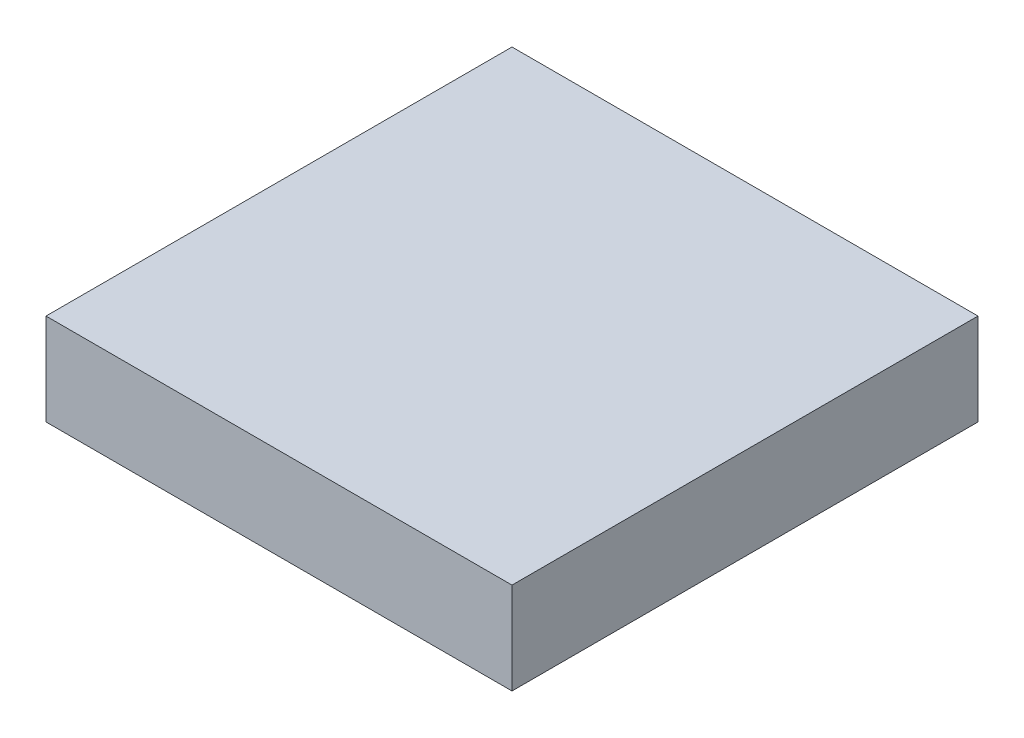
ISO-10303-21;
HEADER;
FILE_DESCRIPTION(('STEP AP214'),'2;1');
FILE_NAME('part.step','',(''),(''),'','','');
FILE_SCHEMA(('AUTOMOTIVE_DESIGN { 1 0 10303 214 1 1 1 1 }'));
ENDSEC;
DATA;
#1=APPLICATION_CONTEXT('core data for automotive mechanical design processes');
#2=APPLICATION_PROTOCOL_DEFINITION('international standard','automotive_design',2000,#1);
#3=PRODUCT_CONTEXT('',#1,'mechanical');
#4=PRODUCT('Part','Part','',(#3));
#5=PRODUCT_RELATED_PRODUCT_CATEGORY('part','',(#4));
#6=PRODUCT_DEFINITION_FORMATION('','',#4);
#7=PRODUCT_DEFINITION_CONTEXT('part definition',#1,'design');
#8=PRODUCT_DEFINITION('design','',#6,#7);
#9=PRODUCT_DEFINITION_SHAPE('','',#8);
#10=(LENGTH_UNIT() NAMED_UNIT(*) SI_UNIT(.MILLI.,.METRE.));
#11=(NAMED_UNIT(*) PLANE_ANGLE_UNIT() SI_UNIT($,.RADIAN.));
#12=(NAMED_UNIT(*) SI_UNIT($,.STERADIAN.) SOLID_ANGLE_UNIT());
#13=UNCERTAINTY_MEASURE_WITH_UNIT(LENGTH_MEASURE(1.E-05),#10,'distance_accuracy_value','');
#14=(GEOMETRIC_REPRESENTATION_CONTEXT(3) GLOBAL_UNCERTAINTY_ASSIGNED_CONTEXT((#13)) GLOBAL_UNIT_ASSIGNED_CONTEXT((#10,
#11,#12)) REPRESENTATION_CONTEXT('',''));
#15=CARTESIAN_POINT('',(0.,0.,0.));
#16=DIRECTION('',(0.,0.,1.));
#17=DIRECTION('',(1.,0.,0.));
#18=AXIS2_PLACEMENT_3D('',#15,#16,#17);
#19=CARTESIAN_POINT('',(76.2,30.,76.2));
#20=DIRECTION('',(-1.,0.,0.));
#21=DIRECTION('',(0.,0.,1.));
#22=AXIS2_PLACEMENT_3D('',#19,#20,#21);
#23=PLANE('',#22);
#24=DIRECTION('',(0.,0.,-1.));
#25=VECTOR('',#24,1.);
#26=CARTESIAN_POINT('',(76.2,0.,76.2));
#27=LINE('',#26,#25);
#28=CARTESIAN_POINT('',(76.2,0.,76.2));
#29=VERTEX_POINT('',#28);
#30=CARTESIAN_POINT('',(76.2,0.,-76.2));
#31=VERTEX_POINT('',#30);
#32=EDGE_CURVE('E97',#29,#31,#27,.T.);
#33=ORIENTED_EDGE('',*,*,#32,.T.);
#34=DIRECTION('',(0.,-1.,0.));
#35=VECTOR('',#34,1.);
#36=CARTESIAN_POINT('',(76.2,30.,-76.2));
#37=LINE('',#36,#35);
#38=CARTESIAN_POINT('',(76.2,30.,-76.2));
#39=VERTEX_POINT('',#38);
#40=EDGE_CURVE('E11',#39,#31,#37,.T.);
#41=ORIENTED_EDGE('',*,*,#40,.F.);
#42=DIRECTION('',(0.,0.,-1.));
#43=VECTOR('',#42,1.);
#44=CARTESIAN_POINT('',(76.2,30.,76.2));
#45=LINE('',#44,#43);
#46=CARTESIAN_POINT('',(76.2,30.,76.2));
#47=VERTEX_POINT('',#46);
#48=EDGE_CURVE('E85',#47,#39,#45,.T.);
#49=ORIENTED_EDGE('',*,*,#48,.F.);
#50=DIRECTION('',(0.,-1.,0.));
#51=VECTOR('',#50,1.);
#52=CARTESIAN_POINT('',(76.2,30.,76.2));
#53=LINE('',#52,#51);
#54=EDGE_CURVE('E93',#47,#29,#53,.T.);
#55=ORIENTED_EDGE('',*,*,#54,.T.);
#56=EDGE_LOOP('',(#33,#41,#49,#55));
#57=FACE_BOUND('',#56,.T.);
#58=ADVANCED_FACE('F34',(#57),#23,.F.);
#59=CARTESIAN_POINT('',(-76.2,30.,-76.2));
#60=DIRECTION('',(0.,0.,1.));
#61=DIRECTION('',(1.,0.,0.));
#62=AXIS2_PLACEMENT_3D('',#59,#60,#61);
#63=PLANE('',#62);
#64=DIRECTION('',(-1.,0.,0.));
#65=VECTOR('',#64,1.);
#66=CARTESIAN_POINT('',(-76.2,0.,-76.2));
#67=LINE('',#66,#65);
#68=CARTESIAN_POINT('',(-76.2,0.,-76.2));
#69=VERTEX_POINT('',#68);
#70=EDGE_CURVE('E89',#31,#69,#67,.T.);
#71=ORIENTED_EDGE('',*,*,#70,.T.);
#72=DIRECTION('',(0.,-1.,0.));
#73=VECTOR('',#72,1.);
#74=CARTESIAN_POINT('',(-76.2,30.,-76.2));
#75=LINE('',#74,#73);
#76=CARTESIAN_POINT('',(-76.2,30.,-76.2));
#77=VERTEX_POINT('',#76);
#78=EDGE_CURVE('E42',#77,#69,#75,.T.);
#79=ORIENTED_EDGE('',*,*,#78,.F.);
#80=DIRECTION('',(-1.,0.,0.));
#81=VECTOR('',#80,1.);
#82=CARTESIAN_POINT('',(-76.2,30.,-76.2));
#83=LINE('',#82,#81);
#84=EDGE_CURVE('E80',#39,#77,#83,.T.);
#85=ORIENTED_EDGE('',*,*,#84,.F.);
#86=ORIENTED_EDGE('',*,*,#40,.T.);
#87=EDGE_LOOP('',(#71,#79,#85,#86));
#88=FACE_BOUND('',#87,.T.);
#89=ADVANCED_FACE('F88',(#88),#63,.F.);
#90=CARTESIAN_POINT('',(-76.2,30.,76.2));
#91=DIRECTION('',(1.,0.,0.));
#92=DIRECTION('',(0.,0.,-1.));
#93=AXIS2_PLACEMENT_3D('',#90,#91,#92);
#94=PLANE('',#93);
#95=DIRECTION('',(0.,0.,1.));
#96=VECTOR('',#95,1.);
#97=CARTESIAN_POINT('',(-76.2,0.,76.2));
#98=LINE('',#97,#96);
#99=CARTESIAN_POINT('',(-76.2,0.,76.2));
#100=VERTEX_POINT('',#99);
#101=EDGE_CURVE('E67',#69,#100,#98,.T.);
#102=ORIENTED_EDGE('',*,*,#101,.T.);
#103=DIRECTION('',(0.,-1.,0.));
#104=VECTOR('',#103,1.);
#105=CARTESIAN_POINT('',(-76.2,30.,76.2));
#106=LINE('',#105,#104);
#107=CARTESIAN_POINT('',(-76.2,30.,76.2));
#108=VERTEX_POINT('',#107);
#109=EDGE_CURVE('E90',#108,#100,#106,.T.);
#110=ORIENTED_EDGE('',*,*,#109,.F.);
#111=DIRECTION('',(0.,0.,1.));
#112=VECTOR('',#111,1.);
#113=CARTESIAN_POINT('',(-76.2,30.,76.2));
#114=LINE('',#113,#112);
#115=EDGE_CURVE('E83',#77,#108,#114,.T.);
#116=ORIENTED_EDGE('',*,*,#115,.F.);
#117=ORIENTED_EDGE('',*,*,#78,.T.);
#118=EDGE_LOOP('',(#102,#110,#116,#117));
#119=FACE_BOUND('',#118,.T.);
#120=ADVANCED_FACE('F91',(#119),#94,.F.);
#121=CARTESIAN_POINT('',(-76.2,30.,76.2));
#122=DIRECTION('',(0.,0.,-1.));
#123=DIRECTION('',(-1.,0.,0.));
#124=AXIS2_PLACEMENT_3D('',#121,#122,#123);
#125=PLANE('',#124);
#126=DIRECTION('',(1.,0.,0.));
#127=VECTOR('',#126,1.);
#128=CARTESIAN_POINT('',(-76.2,0.,76.2));
#129=LINE('',#128,#127);
#130=EDGE_CURVE('E73',#100,#29,#129,.T.);
#131=ORIENTED_EDGE('',*,*,#130,.T.);
#132=ORIENTED_EDGE('',*,*,#54,.F.);
#133=DIRECTION('',(1.,0.,0.));
#134=VECTOR('',#133,1.);
#135=CARTESIAN_POINT('',(-76.2,30.,76.2));
#136=LINE('',#135,#134);
#137=EDGE_CURVE('E50',#108,#47,#136,.T.);
#138=ORIENTED_EDGE('',*,*,#137,.F.);
#139=ORIENTED_EDGE('',*,*,#109,.T.);
#140=EDGE_LOOP('',(#131,#132,#138,#139));
#141=FACE_BOUND('',#140,.T.);
#142=ADVANCED_FACE('F104',(#141),#125,.F.);
#143=CARTESIAN_POINT('',(0.,30.,0.));
#144=DIRECTION('',(0.,-1.,0.));
#145=DIRECTION('',(0.,0.,-1.));
#146=AXIS2_PLACEMENT_3D('',#143,#144,#145);
#147=PLANE('',#146);
#148=ORIENTED_EDGE('',*,*,#48,.T.);
#149=ORIENTED_EDGE('',*,*,#84,.T.);
#150=ORIENTED_EDGE('',*,*,#115,.T.);
#151=ORIENTED_EDGE('',*,*,#137,.T.);
#152=EDGE_LOOP('',(#148,#149,#150,#151));
#153=FACE_BOUND('',#152,.T.);
#154=ADVANCED_FACE('F81',(#153),#147,.F.);
#155=CARTESIAN_POINT('',(0.,0.,0.));
#156=DIRECTION('',(0.,-1.,0.));
#157=DIRECTION('',(0.,0.,-1.));
#158=AXIS2_PLACEMENT_3D('',#155,#156,#157);
#159=PLANE('',#158);
#160=ORIENTED_EDGE('',*,*,#32,.F.);
#161=ORIENTED_EDGE('',*,*,#130,.F.);
#162=ORIENTED_EDGE('',*,*,#101,.F.);
#163=ORIENTED_EDGE('',*,*,#70,.F.);
#164=EDGE_LOOP('',(#160,#161,#162,#163));
#165=FACE_BOUND('',#164,.T.);
#166=ADVANCED_FACE('F107',(#165),#159,.T.);
#167=CLOSED_SHELL('',(#58,#89,#120,#142,#154,#166));
#168=MANIFOLD_SOLID_BREP('B2',#167);
#169=ADVANCED_BREP_SHAPE_REPRESENTATION('',(#18,#168),#14);
#170=SHAPE_DEFINITION_REPRESENTATION(#9,#169);
ENDSEC;
END-ISO-10303-21;
